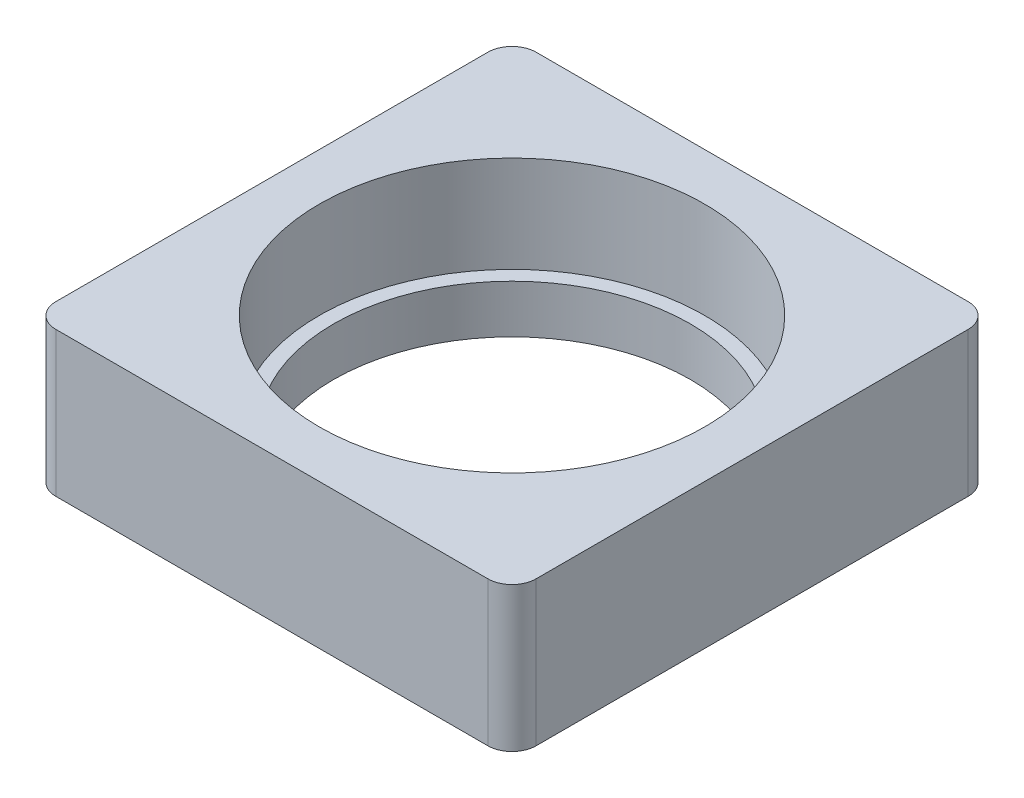
ISO-10303-21;
HEADER;
FILE_DESCRIPTION(('STEP AP214'),'2;1');
FILE_NAME('part.step','',(''),(''),'','','');
FILE_SCHEMA(('AUTOMOTIVE_DESIGN { 1 0 10303 214 1 1 1 1 }'));
ENDSEC;
DATA;
#1=APPLICATION_CONTEXT('core data for automotive mechanical design processes');
#2=APPLICATION_PROTOCOL_DEFINITION('international standard','automotive_design',2000,#1);
#3=PRODUCT_CONTEXT('',#1,'mechanical');
#4=PRODUCT('Part','Part','',(#3));
#5=PRODUCT_RELATED_PRODUCT_CATEGORY('part','',(#4));
#6=PRODUCT_DEFINITION_FORMATION('','',#4);
#7=PRODUCT_DEFINITION_CONTEXT('part definition',#1,'design');
#8=PRODUCT_DEFINITION('design','',#6,#7);
#9=PRODUCT_DEFINITION_SHAPE('','',#8);
#10=(LENGTH_UNIT() NAMED_UNIT(*) SI_UNIT(.MILLI.,.METRE.));
#11=(NAMED_UNIT(*) PLANE_ANGLE_UNIT() SI_UNIT($,.RADIAN.));
#12=(NAMED_UNIT(*) SI_UNIT($,.STERADIAN.) SOLID_ANGLE_UNIT());
#13=UNCERTAINTY_MEASURE_WITH_UNIT(LENGTH_MEASURE(1.E-05),#10,'distance_accuracy_value','');
#14=(GEOMETRIC_REPRESENTATION_CONTEXT(3) GLOBAL_UNCERTAINTY_ASSIGNED_CONTEXT((#13)) GLOBAL_UNIT_ASSIGNED_CONTEXT((#10,
#11,#12)) REPRESENTATION_CONTEXT('',''));
#15=CARTESIAN_POINT('',(0.,0.,0.));
#16=DIRECTION('',(0.,0.,1.));
#17=DIRECTION('',(1.,0.,0.));
#18=AXIS2_PLACEMENT_3D('',#15,#16,#17);
#19=CARTESIAN_POINT('',(1.5748,4.7625,-4.572));
#20=DIRECTION('',(-1.,0.,0.));
#21=DIRECTION('',(0.,0.,1.));
#22=AXIS2_PLACEMENT_3D('',#19,#20,#21);
#23=PLANE('',#22);
#24=CARTESIAN_POINT('',(1.5748,4.7625,-4.572));
#25=DIRECTION('',(-1.,0.,0.));
#26=DIRECTION('',(0.,0.,1.));
#27=AXIS2_PLACEMENT_3D('',#24,#25,#26);
#28=CIRCLE('',#27,3.1623);
#29=CARTESIAN_POINT('',(1.5748,4.7625,-1.4097));
#30=VERTEX_POINT('',#29);
#31=EDGE_CURVE('E236',#30,#30,#28,.T.);
#32=ORIENTED_EDGE('',*,*,#31,.T.);
#33=EDGE_LOOP('',(#32));
#34=FACE_BOUND('',#33,.T.);
#35=ADVANCED_FACE('F17',(#34),#23,.T.);
#36=CARTESIAN_POINT('',(15.8115,-35.9210244842766,-15.8115));
#37=DIRECTION('',(0.,1.,0.));
#38=DIRECTION('',(0.,0.,1.));
#39=AXIS2_PLACEMENT_3D('',#36,#37,#38);
#40=CYLINDRICAL_SURFACE('',#39,12.7);
#41=CARTESIAN_POINT('',(15.8115,3.175,-15.8115));
#42=DIRECTION('',(0.,1.,0.));
#43=DIRECTION('',(0.,0.,1.));
#44=AXIS2_PLACEMENT_3D('',#41,#42,#43);
#45=CIRCLE('',#44,12.7);
#46=CARTESIAN_POINT('',(15.8115,3.175,-3.1115));
#47=VERTEX_POINT('',#46);
#48=EDGE_CURVE('E20',#47,#47,#45,.F.);
#49=ORIENTED_EDGE('',*,*,#48,.T.);
#50=EDGE_LOOP('',(#49));
#51=FACE_BOUND('',#50,.T.);
#52=CARTESIAN_POINT('',(15.8115,9.525,-15.8115));
#53=DIRECTION('',(0.,1.,0.));
#54=DIRECTION('',(0.,0.,1.));
#55=AXIS2_PLACEMENT_3D('',#52,#53,#54);
#56=CIRCLE('',#55,12.7);
#57=CARTESIAN_POINT('',(15.8115,9.525,-3.1115));
#58=VERTEX_POINT('',#57);
#59=EDGE_CURVE('E238',#58,#58,#56,.T.);
#60=ORIENTED_EDGE('',*,*,#59,.T.);
#61=EDGE_LOOP('',(#60));
#62=FACE_BOUND('',#61,.T.);
#63=ADVANCED_FACE('F248',(#51,#62),#40,.F.);
#64=CARTESIAN_POINT('',(0.,3.175,0.));
#65=DIRECTION('',(0.,-1.,0.));
#66=DIRECTION('',(0.,0.,-1.));
#67=AXIS2_PLACEMENT_3D('',#64,#65,#66);
#68=PLANE('',#67);
#69=CARTESIAN_POINT('',(15.8115,3.175,-15.8115));
#70=DIRECTION('',(0.,1.,0.));
#71=DIRECTION('',(0.,0.,1.));
#72=AXIS2_PLACEMENT_3D('',#69,#70,#71);
#73=CIRCLE('',#72,11.7475);
#74=CARTESIAN_POINT('',(15.8115,3.175,-4.064));
#75=VERTEX_POINT('',#74);
#76=EDGE_CURVE('E123',#75,#75,#73,.F.);
#77=ORIENTED_EDGE('',*,*,#76,.T.);
#78=EDGE_LOOP('',(#77));
#79=FACE_BOUND('',#78,.T.);
#80=ORIENTED_EDGE('',*,*,#48,.F.);
#81=EDGE_LOOP('',(#80));
#82=FACE_BOUND('',#81,.T.);
#83=ADVANCED_FACE('F193',(#79,#82),#68,.F.);
#84=CARTESIAN_POINT('',(1.5748,4.7625,-4.572));
#85=DIRECTION('',(-1.,0.,0.));
#86=DIRECTION('',(0.,0.,1.));
#87=AXIS2_PLACEMENT_3D('',#84,#85,#86);
#88=CYLINDRICAL_SURFACE('',#87,3.1623);
#89=CARTESIAN_POINT('',(0.,4.7625,-4.572));
#90=DIRECTION('',(-1.,0.,0.));
#91=DIRECTION('',(0.,0.,1.));
#92=AXIS2_PLACEMENT_3D('',#89,#90,#91);
#93=CIRCLE('',#92,3.1623);
#94=CARTESIAN_POINT('',(0.,5.80791907386464,-1.5875));
#95=VERTEX_POINT('',#94);
#96=CARTESIAN_POINT('',(0.,3.71708092613536,-1.5875));
#97=VERTEX_POINT('',#96);
#98=EDGE_CURVE('E145',#95,#97,#93,.T.);
#99=ORIENTED_EDGE('',*,*,#98,.T.);
#100=CARTESIAN_POINT('',(0.,5.80791907386464,-1.5875));
#101=CARTESIAN_POINT('',(2.21469381864389E-06,5.76543072385641,-1.57261710446023));
#102=CARTESIAN_POINT('',(0.000208960677507276,5.72263085381354,-1.55864380412265));
#103=CARTESIAN_POINT('',(0.000897624958865748,5.63647642581595,-1.53253737760836));
#104=CARTESIAN_POINT('',(0.00137953822386666,5.59312187802019,-1.52040421778156));
#105=CARTESIAN_POINT('',(0.00303694623328012,5.46234767019402,-1.48680112376522));
#106=CARTESIAN_POINT('',(0.00442424096767263,5.374196644088,-1.4681202917167));
#107=CARTESIAN_POINT('',(0.00691701924513229,5.19908724564886,-1.43875921328412));
#108=CARTESIAN_POINT('',(0.00802923257560603,5.11216325983567,-1.42787208949064));
#109=CARTESIAN_POINT('',(0.00956457345174745,4.93770899313758,-1.4133448523383));
#110=CARTESIAN_POINT('',(0.00998776089574341,4.85017876561883,-1.4097041090317));
#111=CARTESIAN_POINT('',(0.00998868227418239,4.67509393769335,-1.40969589680216));
#112=CARTESIAN_POINT('',(0.0095661843419069,4.58753933718492,-1.41333042258415));
#113=CARTESIAN_POINT('',(0.00803156157409693,4.41303611404772,-1.42784925211999));
#114=CARTESIAN_POINT('',(0.00691937644476932,4.32608754507152,-1.43873418972509));
#115=CARTESIAN_POINT('',(0.00442614760161724,4.15092792044109,-1.46809500897624));
#116=CARTESIAN_POINT('',(0.0030383580623584,4.06275126975242,-1.48677794109248));
#117=CARTESIAN_POINT('',(0.00138023691170389,3.93193933726919,-1.52038736834083));
#118=CARTESIAN_POINT('',(0.00089809078376427,3.88857233703908,-1.53252316845373));
#119=CARTESIAN_POINT('',(0.000209078381713718,3.80239329523531,-1.55863592020701));
#120=CARTESIAN_POINT('',(2.21714094926195E-06,3.75958126382295,-1.57261290550673));
#121=CARTESIAN_POINT('',(0.,3.71708092613536,-1.5875));
#122=B_SPLINE_CURVE_WITH_KNOTS('',3,(#100,#101,#102,#103,#104,#105,#106,#107,#108,#109,#110,
#111,#112,#113,#114,#115,#116,#117,#118,#119,#120,#121),.UNSPECIFIED.,.F.,.F.,(4,2,2,2,2,2,2,2,
2,2,4),(0.,0.135035182475541,0.270067895305719,0.540067419621777,0.802603660730558,
1.06511707784674,1.32770247972674,1.59031084056897,1.8603865825587,1.99545738041359,
2.13053064788746),.UNSPECIFIED.);
#123=EDGE_CURVE('E121',#95,#97,#122,.T.);
#124=ORIENTED_EDGE('',*,*,#123,.F.);
#125=EDGE_LOOP('',(#99,#124));
#126=FACE_BOUND('',#125,.T.);
#127=ORIENTED_EDGE('',*,*,#31,.F.);
#128=EDGE_LOOP('',(#127));
#129=FACE_BOUND('',#128,.T.);
#130=ADVANCED_FACE('F157',(#126,#129),#88,.F.);
#131=CARTESIAN_POINT('',(0.,9.525,0.));
#132=DIRECTION('',(0.,-1.,0.));
#133=DIRECTION('',(0.,0.,-1.));
#134=AXIS2_PLACEMENT_3D('',#131,#132,#133);
#135=PLANE('',#134);
#136=CARTESIAN_POINT('',(30.0355,9.525,-30.0355));
#137=DIRECTION('',(0.,-1.,0.));
#138=DIRECTION('',(0.,0.,-1.));
#139=AXIS2_PLACEMENT_3D('',#136,#137,#138);
#140=CIRCLE('',#139,1.5875);
#141=CARTESIAN_POINT('',(30.0355,9.525,-31.623));
#142=VERTEX_POINT('',#141);
#143=CARTESIAN_POINT('',(31.623,9.525,-30.0355));
#144=VERTEX_POINT('',#143);
#145=EDGE_CURVE('E86',#142,#144,#140,.T.);
#146=ORIENTED_EDGE('',*,*,#145,.F.);
#147=DIRECTION('',(1.,0.,0.));
#148=VECTOR('',#147,1.);
#149=CARTESIAN_POINT('',(0.,9.525,-31.623));
#150=LINE('',#149,#148);
#151=CARTESIAN_POINT('',(1.5875,9.525,-31.623));
#152=VERTEX_POINT('',#151);
#153=EDGE_CURVE('E105',#142,#152,#150,.F.);
#154=ORIENTED_EDGE('',*,*,#153,.T.);
#155=CARTESIAN_POINT('',(1.5875,9.525,-30.0355));
#156=DIRECTION('',(0.,-1.,0.));
#157=DIRECTION('',(0.,0.,-1.));
#158=AXIS2_PLACEMENT_3D('',#155,#156,#157);
#159=CIRCLE('',#158,1.5875);
#160=CARTESIAN_POINT('',(0.,9.525,-30.0355));
#161=VERTEX_POINT('',#160);
#162=EDGE_CURVE('E140',#161,#152,#159,.T.);
#163=ORIENTED_EDGE('',*,*,#162,.F.);
#164=DIRECTION('',(0.,0.,-1.));
#165=VECTOR('',#164,1.);
#166=CARTESIAN_POINT('',(0.,9.525,0.));
#167=LINE('',#166,#165);
#168=CARTESIAN_POINT('',(0.,9.525,-1.5875));
#169=VERTEX_POINT('',#168);
#170=EDGE_CURVE('E118',#161,#169,#167,.F.);
#171=ORIENTED_EDGE('',*,*,#170,.T.);
#172=CARTESIAN_POINT('',(1.5875,9.525,-1.5875));
#173=DIRECTION('',(0.,-1.,0.));
#174=DIRECTION('',(0.,0.,-1.));
#175=AXIS2_PLACEMENT_3D('',#172,#173,#174);
#176=CIRCLE('',#175,1.5875);
#177=CARTESIAN_POINT('',(1.5875,9.525,0.));
#178=VERTEX_POINT('',#177);
#179=EDGE_CURVE('E149',#178,#169,#176,.T.);
#180=ORIENTED_EDGE('',*,*,#179,.F.);
#181=DIRECTION('',(-1.,0.,0.));
#182=VECTOR('',#181,1.);
#183=CARTESIAN_POINT('',(0.,9.525,0.));
#184=LINE('',#183,#182);
#185=CARTESIAN_POINT('',(30.0355,9.525,0.));
#186=VERTEX_POINT('',#185);
#187=EDGE_CURVE('E124',#178,#186,#184,.F.);
#188=ORIENTED_EDGE('',*,*,#187,.T.);
#189=CARTESIAN_POINT('',(30.0355,9.525,-1.5875));
#190=DIRECTION('',(0.,-1.,0.));
#191=DIRECTION('',(0.,0.,-1.));
#192=AXIS2_PLACEMENT_3D('',#189,#190,#191);
#193=CIRCLE('',#192,1.5875);
#194=CARTESIAN_POINT('',(31.623,9.525,-1.5875));
#195=VERTEX_POINT('',#194);
#196=EDGE_CURVE('E93',#195,#186,#193,.T.);
#197=ORIENTED_EDGE('',*,*,#196,.F.);
#198=DIRECTION('',(0.,0.,1.));
#199=VECTOR('',#198,1.);
#200=CARTESIAN_POINT('',(31.623,9.525,0.));
#201=LINE('',#200,#199);
#202=EDGE_CURVE('E89',#195,#144,#201,.F.);
#203=ORIENTED_EDGE('',*,*,#202,.T.);
#204=EDGE_LOOP('',(#146,#154,#163,#171,#180,#188,#197,#203));
#205=FACE_BOUND('',#204,.T.);
#206=ORIENTED_EDGE('',*,*,#59,.F.);
#207=EDGE_LOOP('',(#206));
#208=FACE_BOUND('',#207,.T.);
#209=ADVANCED_FACE('F90',(#205,#208),#135,.F.);
#210=CARTESIAN_POINT('',(15.8115,0.,-15.8115));
#211=DIRECTION('',(0.,1.,0.));
#212=DIRECTION('',(0.,0.,1.));
#213=AXIS2_PLACEMENT_3D('',#210,#211,#212);
#214=CYLINDRICAL_SURFACE('',#213,11.7475);
#215=ORIENTED_EDGE('',*,*,#76,.F.);
#216=EDGE_LOOP('',(#215));
#217=FACE_BOUND('',#216,.T.);
#218=CARTESIAN_POINT('',(15.8115,0.,-15.8115));
#219=DIRECTION('',(0.,1.,0.));
#220=DIRECTION('',(0.,0.,1.));
#221=AXIS2_PLACEMENT_3D('',#218,#219,#220);
#222=CIRCLE('',#221,11.7475);
#223=CARTESIAN_POINT('',(15.8115,0.,-4.064));
#224=VERTEX_POINT('',#223);
#225=EDGE_CURVE('E137',#224,#224,#222,.T.);
#226=ORIENTED_EDGE('',*,*,#225,.F.);
#227=EDGE_LOOP('',(#226));
#228=FACE_BOUND('',#227,.T.);
#229=ADVANCED_FACE('F184',(#217,#228),#214,.F.);
#230=CARTESIAN_POINT('',(0.,9.525,-31.623));
#231=DIRECTION('',(0.,0.,1.));
#232=DIRECTION('',(1.,0.,0.));
#233=AXIS2_PLACEMENT_3D('',#230,#231,#232);
#234=PLANE('',#233);
#235=DIRECTION('',(0.,-1.,0.));
#236=VECTOR('',#235,1.);
#237=CARTESIAN_POINT('',(30.0355,9.525,-31.623));
#238=LINE('',#237,#236);
#239=CARTESIAN_POINT('',(30.0355,0.,-31.623));
#240=VERTEX_POINT('',#239);
#241=EDGE_CURVE('E98',#240,#142,#238,.F.);
#242=ORIENTED_EDGE('',*,*,#241,.F.);
#243=DIRECTION('',(1.,0.,0.));
#244=VECTOR('',#243,1.);
#245=CARTESIAN_POINT('',(0.,0.,-31.623));
#246=LINE('',#245,#244);
#247=CARTESIAN_POINT('',(1.5875,0.,-31.623));
#248=VERTEX_POINT('',#247);
#249=EDGE_CURVE('E136',#248,#240,#246,.T.);
#250=ORIENTED_EDGE('',*,*,#249,.F.);
#251=DIRECTION('',(0.,-1.,0.));
#252=VECTOR('',#251,1.);
#253=CARTESIAN_POINT('',(1.5875,9.525,-31.623));
#254=LINE('',#253,#252);
#255=EDGE_CURVE('E143',#152,#248,#254,.T.);
#256=ORIENTED_EDGE('',*,*,#255,.F.);
#257=ORIENTED_EDGE('',*,*,#153,.F.);
#258=EDGE_LOOP('',(#242,#250,#256,#257));
#259=FACE_BOUND('',#258,.T.);
#260=ADVANCED_FACE('F181',(#259),#234,.F.);
#261=CARTESIAN_POINT('',(30.0355,9.525,-30.0355));
#262=DIRECTION('',(0.,-1.,0.));
#263=DIRECTION('',(0.,0.,-1.));
#264=AXIS2_PLACEMENT_3D('',#261,#262,#263);
#265=CYLINDRICAL_SURFACE('',#264,1.5875);
#266=CARTESIAN_POINT('',(30.0355,0.,-30.0355));
#267=DIRECTION('',(0.,-1.,0.));
#268=DIRECTION('',(0.,0.,-1.));
#269=AXIS2_PLACEMENT_3D('',#266,#267,#268);
#270=CIRCLE('',#269,1.5875);
#271=CARTESIAN_POINT('',(31.623,0.,-30.0355));
#272=VERTEX_POINT('',#271);
#273=EDGE_CURVE('E134',#240,#272,#270,.T.);
#274=ORIENTED_EDGE('',*,*,#273,.F.);
#275=ORIENTED_EDGE('',*,*,#241,.T.);
#276=ORIENTED_EDGE('',*,*,#145,.T.);
#277=DIRECTION('',(0.,1.,0.));
#278=VECTOR('',#277,1.);
#279=CARTESIAN_POINT('',(31.623,9.525,-30.0355));
#280=LINE('',#279,#278);
#281=EDGE_CURVE('E97',#144,#272,#280,.F.);
#282=ORIENTED_EDGE('',*,*,#281,.T.);
#283=EDGE_LOOP('',(#274,#275,#276,#282));
#284=FACE_BOUND('',#283,.T.);
#285=ADVANCED_FACE('F103',(#284),#265,.T.);
#286=CARTESIAN_POINT('',(31.623,9.525,0.));
#287=DIRECTION('',(-1.,0.,0.));
#288=DIRECTION('',(0.,0.,1.));
#289=AXIS2_PLACEMENT_3D('',#286,#287,#288);
#290=PLANE('',#289);
#291=ORIENTED_EDGE('',*,*,#281,.F.);
#292=ORIENTED_EDGE('',*,*,#202,.F.);
#293=DIRECTION('',(0.,-1.,0.));
#294=VECTOR('',#293,1.);
#295=CARTESIAN_POINT('',(31.623,9.525,-1.5875));
#296=LINE('',#295,#294);
#297=CARTESIAN_POINT('',(31.623,0.,-1.5875));
#298=VERTEX_POINT('',#297);
#299=EDGE_CURVE('E112',#298,#195,#296,.F.);
#300=ORIENTED_EDGE('',*,*,#299,.F.);
#301=DIRECTION('',(0.,0.,-1.));
#302=VECTOR('',#301,1.);
#303=CARTESIAN_POINT('',(31.623,0.,0.));
#304=LINE('',#303,#302);
#305=EDGE_CURVE('E109',#272,#298,#304,.F.);
#306=ORIENTED_EDGE('',*,*,#305,.F.);
#307=EDGE_LOOP('',(#291,#292,#300,#306));
#308=FACE_BOUND('',#307,.T.);
#309=ADVANCED_FACE('F107',(#308),#290,.F.);
#310=CARTESIAN_POINT('',(30.0355,9.525,-1.5875));
#311=DIRECTION('',(0.,-1.,0.));
#312=DIRECTION('',(0.,0.,-1.));
#313=AXIS2_PLACEMENT_3D('',#310,#311,#312);
#314=CYLINDRICAL_SURFACE('',#313,1.5875);
#315=CARTESIAN_POINT('',(30.0355,0.,-1.5875));
#316=DIRECTION('',(0.,-1.,0.));
#317=DIRECTION('',(0.,0.,-1.));
#318=AXIS2_PLACEMENT_3D('',#315,#316,#317);
#319=CIRCLE('',#318,1.5875);
#320=CARTESIAN_POINT('',(30.0355,0.,0.));
#321=VERTEX_POINT('',#320);
#322=EDGE_CURVE('E131',#298,#321,#319,.T.);
#323=ORIENTED_EDGE('',*,*,#322,.F.);
#324=ORIENTED_EDGE('',*,*,#299,.T.);
#325=ORIENTED_EDGE('',*,*,#196,.T.);
#326=DIRECTION('',(0.,1.,0.));
#327=VECTOR('',#326,1.);
#328=CARTESIAN_POINT('',(30.0355,9.525,0.));
#329=LINE('',#328,#327);
#330=EDGE_CURVE('E125',#186,#321,#329,.F.);
#331=ORIENTED_EDGE('',*,*,#330,.T.);
#332=EDGE_LOOP('',(#323,#324,#325,#331));
#333=FACE_BOUND('',#332,.T.);
#334=ADVANCED_FACE('F172',(#333),#314,.T.);
#335=CARTESIAN_POINT('',(0.,9.525,0.));
#336=DIRECTION('',(0.,0.,-1.));
#337=DIRECTION('',(-1.,0.,0.));
#338=AXIS2_PLACEMENT_3D('',#335,#336,#337);
#339=PLANE('',#338);
#340=ORIENTED_EDGE('',*,*,#330,.F.);
#341=ORIENTED_EDGE('',*,*,#187,.F.);
#342=DIRECTION('',(0.,-1.,0.));
#343=VECTOR('',#342,1.);
#344=CARTESIAN_POINT('',(1.5875,9.525,0.));
#345=LINE('',#344,#343);
#346=CARTESIAN_POINT('',(1.5875,0.,0.));
#347=VERTEX_POINT('',#346);
#348=EDGE_CURVE('E223',#347,#178,#345,.F.);
#349=ORIENTED_EDGE('',*,*,#348,.F.);
#350=DIRECTION('',(1.,0.,0.));
#351=VECTOR('',#350,1.);
#352=CARTESIAN_POINT('',(0.,0.,0.));
#353=LINE('',#352,#351);
#354=EDGE_CURVE('E130',#321,#347,#353,.F.);
#355=ORIENTED_EDGE('',*,*,#354,.F.);
#356=EDGE_LOOP('',(#340,#341,#349,#355));
#357=FACE_BOUND('',#356,.T.);
#358=ADVANCED_FACE('F167',(#357),#339,.F.);
#359=CARTESIAN_POINT('',(1.5875,9.525,-1.5875));
#360=DIRECTION('',(0.,-1.,0.));
#361=DIRECTION('',(0.,0.,-1.));
#362=AXIS2_PLACEMENT_3D('',#359,#360,#361);
#363=CYLINDRICAL_SURFACE('',#362,1.5875);
#364=DIRECTION('',(0.,1.,0.));
#365=VECTOR('',#364,1.);
#366=CARTESIAN_POINT('',(0.,9.525,-1.5875));
#367=LINE('',#366,#365);
#368=EDGE_CURVE('E120',#169,#95,#367,.F.);
#369=ORIENTED_EDGE('',*,*,#368,.T.);
#370=ORIENTED_EDGE('',*,*,#123,.T.);
#371=DIRECTION('',(0.,1.,0.));
#372=VECTOR('',#371,1.);
#373=CARTESIAN_POINT('',(0.,9.525,-1.5875));
#374=LINE('',#373,#372);
#375=CARTESIAN_POINT('',(0.,0.,-1.5875));
#376=VERTEX_POINT('',#375);
#377=EDGE_CURVE('E144',#97,#376,#374,.F.);
#378=ORIENTED_EDGE('',*,*,#377,.T.);
#379=CARTESIAN_POINT('',(1.5875,0.,-1.5875));
#380=DIRECTION('',(0.,-1.,0.));
#381=DIRECTION('',(0.,0.,-1.));
#382=AXIS2_PLACEMENT_3D('',#379,#380,#381);
#383=CIRCLE('',#382,1.5875);
#384=EDGE_CURVE('E127',#347,#376,#383,.T.);
#385=ORIENTED_EDGE('',*,*,#384,.F.);
#386=ORIENTED_EDGE('',*,*,#348,.T.);
#387=ORIENTED_EDGE('',*,*,#179,.T.);
#388=EDGE_LOOP('',(#369,#370,#378,#385,#386,#387));
#389=FACE_BOUND('',#388,.T.);
#390=ADVANCED_FACE('F161',(#389),#363,.T.);
#391=CARTESIAN_POINT('',(0.,9.525,0.));
#392=DIRECTION('',(1.,0.,0.));
#393=DIRECTION('',(0.,0.,-1.));
#394=AXIS2_PLACEMENT_3D('',#391,#392,#393);
#395=PLANE('',#394);
#396=ORIENTED_EDGE('',*,*,#98,.F.);
#397=ORIENTED_EDGE('',*,*,#368,.F.);
#398=ORIENTED_EDGE('',*,*,#170,.F.);
#399=DIRECTION('',(0.,-1.,0.));
#400=VECTOR('',#399,1.);
#401=CARTESIAN_POINT('',(0.,9.525,-30.0355));
#402=LINE('',#401,#400);
#403=CARTESIAN_POINT('',(0.,0.,-30.0355));
#404=VERTEX_POINT('',#403);
#405=EDGE_CURVE('E35',#404,#161,#402,.F.);
#406=ORIENTED_EDGE('',*,*,#405,.F.);
#407=DIRECTION('',(0.,0.,-1.));
#408=VECTOR('',#407,1.);
#409=CARTESIAN_POINT('',(0.,0.,0.));
#410=LINE('',#409,#408);
#411=EDGE_CURVE('E26',#376,#404,#410,.T.);
#412=ORIENTED_EDGE('',*,*,#411,.F.);
#413=ORIENTED_EDGE('',*,*,#377,.F.);
#414=EDGE_LOOP('',(#396,#397,#398,#406,#412,#413));
#415=FACE_BOUND('',#414,.T.);
#416=ADVANCED_FACE('F166',(#415),#395,.F.);
#417=CARTESIAN_POINT('',(1.5875,9.525,-30.0355));
#418=DIRECTION('',(0.,-1.,0.));
#419=DIRECTION('',(0.,0.,-1.));
#420=AXIS2_PLACEMENT_3D('',#417,#418,#419);
#421=CYLINDRICAL_SURFACE('',#420,1.5875);
#422=CARTESIAN_POINT('',(1.5875,0.,-30.0355));
#423=DIRECTION('',(0.,-1.,0.));
#424=DIRECTION('',(0.,0.,-1.));
#425=AXIS2_PLACEMENT_3D('',#422,#423,#424);
#426=CIRCLE('',#425,1.5875);
#427=EDGE_CURVE('E11',#404,#248,#426,.T.);
#428=ORIENTED_EDGE('',*,*,#427,.F.);
#429=ORIENTED_EDGE('',*,*,#405,.T.);
#430=ORIENTED_EDGE('',*,*,#162,.T.);
#431=ORIENTED_EDGE('',*,*,#255,.T.);
#432=EDGE_LOOP('',(#428,#429,#430,#431));
#433=FACE_BOUND('',#432,.T.);
#434=ADVANCED_FACE('F197',(#433),#421,.T.);
#435=CARTESIAN_POINT('',(0.,0.,0.));
#436=DIRECTION('',(0.,-1.,0.));
#437=DIRECTION('',(0.,0.,-1.));
#438=AXIS2_PLACEMENT_3D('',#435,#436,#437);
#439=PLANE('',#438);
#440=ORIENTED_EDGE('',*,*,#411,.T.);
#441=ORIENTED_EDGE('',*,*,#427,.T.);
#442=ORIENTED_EDGE('',*,*,#249,.T.);
#443=ORIENTED_EDGE('',*,*,#273,.T.);
#444=ORIENTED_EDGE('',*,*,#305,.T.);
#445=ORIENTED_EDGE('',*,*,#322,.T.);
#446=ORIENTED_EDGE('',*,*,#354,.T.);
#447=ORIENTED_EDGE('',*,*,#384,.T.);
#448=EDGE_LOOP('',(#440,#441,#442,#443,#444,#445,#446,#447));
#449=FACE_BOUND('',#448,.T.);
#450=ORIENTED_EDGE('',*,*,#225,.T.);
#451=EDGE_LOOP('',(#450));
#452=FACE_BOUND('',#451,.T.);
#453=ADVANCED_FACE('F195',(#449,#452),#439,.T.);
#454=CLOSED_SHELL('',(#35,#63,#83,#130,#209,#229,#260,#285,#309,#334,#358,#390,#416,#434,#453));
#455=MANIFOLD_SOLID_BREP('B1',#454);
#456=ADVANCED_BREP_SHAPE_REPRESENTATION('',(#18,#455),#14);
#457=SHAPE_DEFINITION_REPRESENTATION(#9,#456);
ENDSEC;
END-ISO-10303-21;
